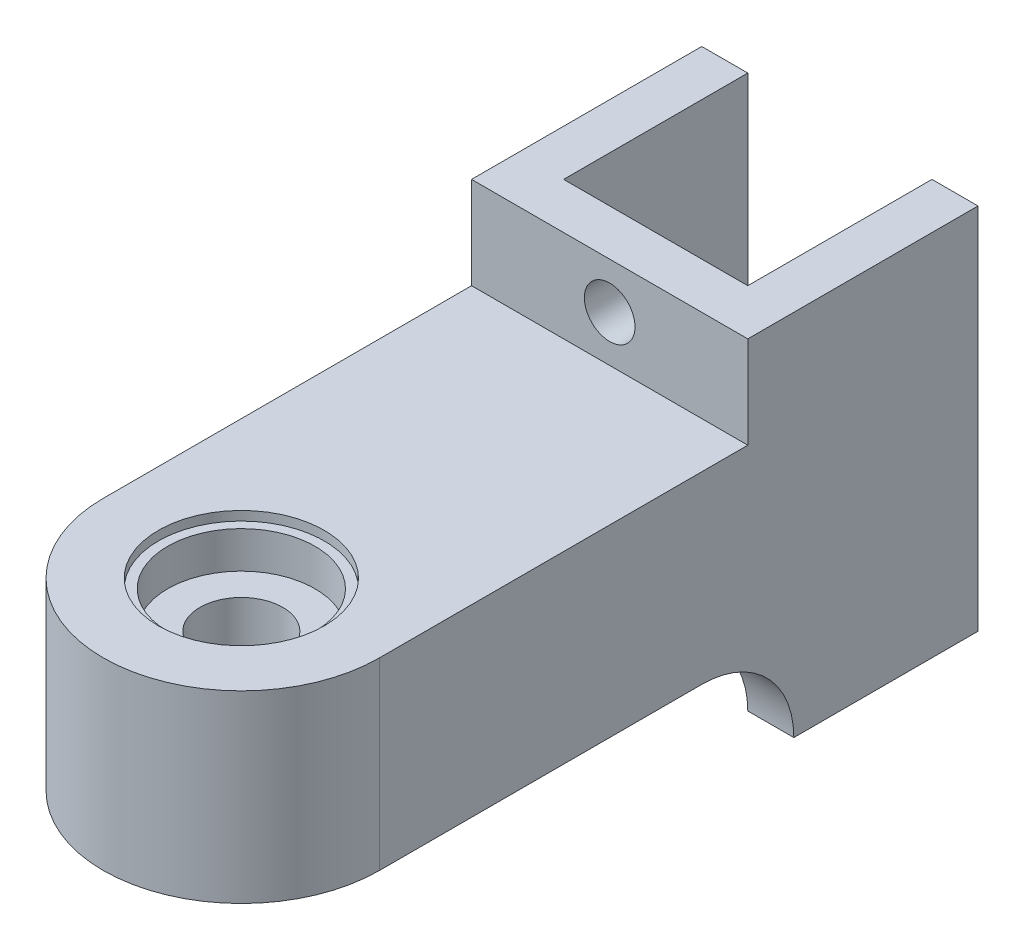
ISO-10303-21;
HEADER;
FILE_DESCRIPTION(('STEP AP214'),'2;1');
FILE_NAME('part.step','',(''),(''),'','','');
FILE_SCHEMA(('AUTOMOTIVE_DESIGN { 1 0 10303 214 1 1 1 1 }'));
ENDSEC;
DATA;
#1=APPLICATION_CONTEXT('core data for automotive mechanical design processes');
#2=APPLICATION_PROTOCOL_DEFINITION('international standard','automotive_design',2000,#1);
#3=PRODUCT_CONTEXT('',#1,'mechanical');
#4=PRODUCT('Part','Part','',(#3));
#5=PRODUCT_RELATED_PRODUCT_CATEGORY('part','',(#4));
#6=PRODUCT_DEFINITION_FORMATION('','',#4);
#7=PRODUCT_DEFINITION_CONTEXT('part definition',#1,'design');
#8=PRODUCT_DEFINITION('design','',#6,#7);
#9=PRODUCT_DEFINITION_SHAPE('','',#8);
#10=(LENGTH_UNIT() NAMED_UNIT(*) SI_UNIT(.MILLI.,.METRE.));
#11=(NAMED_UNIT(*) PLANE_ANGLE_UNIT() SI_UNIT($,.RADIAN.));
#12=(NAMED_UNIT(*) SI_UNIT($,.STERADIAN.) SOLID_ANGLE_UNIT());
#13=UNCERTAINTY_MEASURE_WITH_UNIT(LENGTH_MEASURE(1.E-05),#10,'distance_accuracy_value','');
#14=(GEOMETRIC_REPRESENTATION_CONTEXT(3) GLOBAL_UNCERTAINTY_ASSIGNED_CONTEXT((#13)) GLOBAL_UNIT_ASSIGNED_CONTEXT((#10,
#11,#12)) REPRESENTATION_CONTEXT('',''));
#15=CARTESIAN_POINT('',(0.,0.,0.));
#16=DIRECTION('',(0.,0.,1.));
#17=DIRECTION('',(1.,0.,0.));
#18=AXIS2_PLACEMENT_3D('',#15,#16,#17);
#19=CARTESIAN_POINT('',(0.,10.,0.));
#20=DIRECTION('',(0.,1.,0.));
#21=DIRECTION('',(0.,0.,1.));
#22=AXIS2_PLACEMENT_3D('',#19,#20,#21);
#23=PLANE('',#22);
#24=CARTESIAN_POINT('',(0.593220338983041,10.,56.3559322033898));
#25=DIRECTION('',(0.,1.,0.));
#26=DIRECTION('',(0.,0.,1.));
#27=AXIS2_PLACEMENT_3D('',#24,#25,#26);
#28=CIRCLE('',#27,9.);
#29=CARTESIAN_POINT('',(0.593220338983041,10.,65.3559322033898));
#30=VERTEX_POINT('',#29);
#31=EDGE_CURVE('E223',#30,#30,#28,.T.);
#32=ORIENTED_EDGE('',*,*,#31,.F.);
#33=EDGE_LOOP('',(#32));
#34=FACE_BOUND('',#33,.T.);
#35=DIRECTION('',(0.,0.,1.));
#36=VECTOR('',#35,1.);
#37=CARTESIAN_POINT('',(15.593220338983,10.,0.));
#38=LINE('',#37,#36);
#39=CARTESIAN_POINT('',(15.593220338983,10.,16.3559322033898));
#40=VERTEX_POINT('',#39);
#41=CARTESIAN_POINT('',(15.593220338983,10.,56.3559322033898));
#42=VERTEX_POINT('',#41);
#43=EDGE_CURVE('E220',#40,#42,#38,.T.);
#44=ORIENTED_EDGE('',*,*,#43,.F.);
#45=DIRECTION('',(1.,0.,0.));
#46=VECTOR('',#45,1.);
#47=CARTESIAN_POINT('',(-14.406779661017,10.,16.3559322033898));
#48=LINE('',#47,#46);
#49=CARTESIAN_POINT('',(-14.406779661017,10.,16.3559322033898));
#50=VERTEX_POINT('',#49);
#51=EDGE_CURVE('E158',#50,#40,#48,.T.);
#52=ORIENTED_EDGE('',*,*,#51,.F.);
#53=DIRECTION('',(0.,0.,1.));
#54=VECTOR('',#53,1.);
#55=CARTESIAN_POINT('',(-14.406779661017,10.,0.));
#56=LINE('',#55,#54);
#57=CARTESIAN_POINT('',(-14.406779661017,10.,56.3559322033898));
#58=VERTEX_POINT('',#57);
#59=EDGE_CURVE('E163',#50,#58,#56,.T.);
#60=ORIENTED_EDGE('',*,*,#59,.T.);
#61=CARTESIAN_POINT('',(0.593220338983041,10.,56.3559322033898));
#62=DIRECTION('',(0.,1.,0.));
#63=DIRECTION('',(0.,0.,1.));
#64=AXIS2_PLACEMENT_3D('',#61,#62,#63);
#65=CIRCLE('',#64,15.);
#66=EDGE_CURVE('E217',#58,#42,#65,.T.);
#67=ORIENTED_EDGE('',*,*,#66,.T.);
#68=EDGE_LOOP('',(#44,#52,#60,#67));
#69=FACE_BOUND('',#68,.T.);
#70=ADVANCED_FACE('F35',(#34,#69),#23,.T.);
#71=CARTESIAN_POINT('',(0.593220338983041,-9.,56.3559322033898));
#72=DIRECTION('',(0.,1.,0.));
#73=DIRECTION('',(0.,0.,1.));
#74=AXIS2_PLACEMENT_3D('',#71,#72,#73);
#75=CYLINDRICAL_SURFACE('',#74,8.);
#76=CARTESIAN_POINT('',(0.593220338983041,-9.,56.3559322033898));
#77=DIRECTION('',(0.,1.,0.));
#78=DIRECTION('',(0.,0.,1.));
#79=AXIS2_PLACEMENT_3D('',#76,#77,#78);
#80=CIRCLE('',#79,8.);
#81=CARTESIAN_POINT('',(0.593220338983041,-9.,64.3559322033898));
#82=VERTEX_POINT('',#81);
#83=EDGE_CURVE('E214',#82,#82,#80,.T.);
#84=ORIENTED_EDGE('',*,*,#83,.F.);
#85=EDGE_LOOP('',(#84));
#86=FACE_BOUND('',#85,.T.);
#87=CARTESIAN_POINT('',(0.593220338983041,-5.,56.3559322033898));
#88=DIRECTION('',(0.,1.,0.));
#89=DIRECTION('',(0.,0.,1.));
#90=AXIS2_PLACEMENT_3D('',#87,#88,#89);
#91=CIRCLE('',#90,8.);
#92=CARTESIAN_POINT('',(0.593220338983041,-5.,64.3559322033898));
#93=VERTEX_POINT('',#92);
#94=EDGE_CURVE('E258',#93,#93,#91,.F.);
#95=ORIENTED_EDGE('',*,*,#94,.F.);
#96=EDGE_LOOP('',(#95));
#97=FACE_BOUND('',#96,.T.);
#98=ADVANCED_FACE('F329',(#86,#97),#75,.F.);
#99=CARTESIAN_POINT('',(0.593220338983041,-10.,56.3559322033898));
#100=DIRECTION('',(0.,1.,0.));
#101=DIRECTION('',(0.,0.,1.));
#102=AXIS2_PLACEMENT_3D('',#99,#100,#101);
#103=CYLINDRICAL_SURFACE('',#102,9.);
#104=CARTESIAN_POINT('',(0.593220338983041,-10.,56.3559322033898));
#105=DIRECTION('',(0.,1.,0.));
#106=DIRECTION('',(0.,0.,1.));
#107=AXIS2_PLACEMENT_3D('',#104,#105,#106);
#108=CIRCLE('',#107,9.);
#109=CARTESIAN_POINT('',(0.593220338983041,-10.,65.3559322033898));
#110=VERTEX_POINT('',#109);
#111=EDGE_CURVE('E235',#110,#110,#108,.T.);
#112=ORIENTED_EDGE('',*,*,#111,.F.);
#113=EDGE_LOOP('',(#112));
#114=FACE_BOUND('',#113,.T.);
#115=CARTESIAN_POINT('',(0.593220338983041,-9.,56.3559322033898));
#116=DIRECTION('',(0.,1.,0.));
#117=DIRECTION('',(0.,0.,1.));
#118=AXIS2_PLACEMENT_3D('',#115,#116,#117);
#119=CIRCLE('',#118,9.);
#120=CARTESIAN_POINT('',(0.593220338983041,-9.,65.3559322033898));
#121=VERTEX_POINT('',#120);
#122=EDGE_CURVE('E241',#121,#121,#119,.F.);
#123=ORIENTED_EDGE('',*,*,#122,.F.);
#124=EDGE_LOOP('',(#123));
#125=FACE_BOUND('',#124,.T.);
#126=ADVANCED_FACE('F335',(#114,#125),#103,.F.);
#127=CARTESIAN_POINT('',(0.593220338983041,-10.,56.3559322033898));
#128=DIRECTION('',(0.,1.,0.));
#129=DIRECTION('',(0.,0.,1.));
#130=AXIS2_PLACEMENT_3D('',#127,#128,#129);
#131=CYLINDRICAL_SURFACE('',#130,15.);
#132=DIRECTION('',(0.,1.,0.));
#133=VECTOR('',#132,1.);
#134=CARTESIAN_POINT('',(15.593220338983,-10.,56.3559322033898));
#135=LINE('',#134,#133);
#136=CARTESIAN_POINT('',(15.593220338983,-10.,56.3559322033898));
#137=VERTEX_POINT('',#136);
#138=EDGE_CURVE('E238',#137,#42,#135,.T.);
#139=ORIENTED_EDGE('',*,*,#138,.T.);
#140=ORIENTED_EDGE('',*,*,#66,.F.);
#141=DIRECTION('',(0.,1.,0.));
#142=VECTOR('',#141,1.);
#143=CARTESIAN_POINT('',(-14.406779661017,-10.,56.3559322033898));
#144=LINE('',#143,#142);
#145=CARTESIAN_POINT('',(-14.406779661017,-10.,56.3559322033898));
#146=VERTEX_POINT('',#145);
#147=EDGE_CURVE('E239',#146,#58,#144,.T.);
#148=ORIENTED_EDGE('',*,*,#147,.F.);
#149=CARTESIAN_POINT('',(0.593220338983041,-10.,56.3559322033898));
#150=DIRECTION('',(0.,1.,0.));
#151=DIRECTION('',(0.,0.,1.));
#152=AXIS2_PLACEMENT_3D('',#149,#150,#151);
#153=CIRCLE('',#152,15.);
#154=EDGE_CURVE('E226',#146,#137,#153,.T.);
#155=ORIENTED_EDGE('',*,*,#154,.T.);
#156=EDGE_LOOP('',(#139,#140,#148,#155));
#157=FACE_BOUND('',#156,.T.);
#158=ADVANCED_FACE('F306',(#157),#131,.T.);
#159=CARTESIAN_POINT('',(-14.406779661017,-10.,0.));
#160=DIRECTION('',(-1.,0.,0.));
#161=DIRECTION('',(0.,0.,1.));
#162=AXIS2_PLACEMENT_3D('',#159,#160,#161);
#163=PLANE('',#162);
#164=ORIENTED_EDGE('',*,*,#59,.F.);
#165=DIRECTION('',(0.,-1.,0.));
#166=VECTOR('',#165,1.);
#167=CARTESIAN_POINT('',(-14.406779661017,20.,16.3559322033898));
#168=LINE('',#167,#166);
#169=CARTESIAN_POINT('',(-14.406779661017,20.,16.3559322033898));
#170=VERTEX_POINT('',#169);
#171=EDGE_CURVE('E153',#170,#50,#168,.T.);
#172=ORIENTED_EDGE('',*,*,#171,.F.);
#173=DIRECTION('',(0.,0.,1.));
#174=VECTOR('',#173,1.);
#175=CARTESIAN_POINT('',(-14.406779661017,20.,11.3559322033898));
#176=LINE('',#175,#174);
#177=CARTESIAN_POINT('',(-14.406779661017,20.,-8.64406779661018));
#178=VERTEX_POINT('',#177);
#179=EDGE_CURVE('E137',#178,#170,#176,.T.);
#180=ORIENTED_EDGE('',*,*,#179,.F.);
#181=DIRECTION('',(0.,1.,0.));
#182=VECTOR('',#181,1.);
#183=CARTESIAN_POINT('',(-14.406779661017,-10.,-8.64406779661018));
#184=LINE('',#183,#182);
#185=CARTESIAN_POINT('',(-14.406779661017,-20.,-8.64406779661018));
#186=VERTEX_POINT('',#185);
#187=EDGE_CURVE('E242',#186,#178,#184,.T.);
#188=ORIENTED_EDGE('',*,*,#187,.F.);
#189=DIRECTION('',(0.,0.,1.));
#190=VECTOR('',#189,1.);
#191=CARTESIAN_POINT('',(-14.406779661017,-20.,11.3559322033898));
#192=LINE('',#191,#190);
#193=CARTESIAN_POINT('',(-14.406779661017,-20.,11.3559322033898));
#194=VERTEX_POINT('',#193);
#195=EDGE_CURVE('E176',#186,#194,#192,.T.);
#196=ORIENTED_EDGE('',*,*,#195,.T.);
#197=CARTESIAN_POINT('',(-14.406779661017,-20.,21.3559322033898));
#198=DIRECTION('',(-1.,0.,0.));
#199=DIRECTION('',(0.,0.,1.));
#200=AXIS2_PLACEMENT_3D('',#197,#198,#199);
#201=CIRCLE('',#200,10.);
#202=CARTESIAN_POINT('',(-14.406779661017,-10.,21.3559322033898));
#203=VERTEX_POINT('',#202);
#204=EDGE_CURVE('E271',#194,#203,#201,.F.);
#205=ORIENTED_EDGE('',*,*,#204,.T.);
#206=DIRECTION('',(0.,0.,1.));
#207=VECTOR('',#206,1.);
#208=CARTESIAN_POINT('',(-14.406779661017,-10.,0.));
#209=LINE('',#208,#207);
#210=EDGE_CURVE('E233',#203,#146,#209,.T.);
#211=ORIENTED_EDGE('',*,*,#210,.T.);
#212=ORIENTED_EDGE('',*,*,#147,.T.);
#213=EDGE_LOOP('',(#164,#172,#180,#188,#196,#205,#211,#212));
#214=FACE_BOUND('',#213,.T.);
#215=ADVANCED_FACE('F161',(#214),#163,.T.);
#216=CARTESIAN_POINT('',(0.,-10.,-8.64406779661018));
#217=DIRECTION('',(0.,0.,1.));
#218=DIRECTION('',(1.,0.,0.));
#219=AXIS2_PLACEMENT_3D('',#216,#217,#218);
#220=PLANE('',#219);
#221=ORIENTED_EDGE('',*,*,#187,.T.);
#222=DIRECTION('',(-1.,0.,0.));
#223=VECTOR('',#222,1.);
#224=CARTESIAN_POINT('',(-9.40677966101696,20.,-8.64406779661018));
#225=LINE('',#224,#223);
#226=CARTESIAN_POINT('',(-9.40677966101696,20.,-8.64406779661018));
#227=VERTEX_POINT('',#226);
#228=EDGE_CURVE('E146',#227,#178,#225,.T.);
#229=ORIENTED_EDGE('',*,*,#228,.F.);
#230=DIRECTION('',(0.,1.,0.));
#231=VECTOR('',#230,1.);
#232=CARTESIAN_POINT('',(-9.40677966101696,-10.,-8.64406779661018));
#233=LINE('',#232,#231);
#234=CARTESIAN_POINT('',(-9.40677966101696,-20.,-8.64406779661018));
#235=VERTEX_POINT('',#234);
#236=EDGE_CURVE('E244',#235,#227,#233,.T.);
#237=ORIENTED_EDGE('',*,*,#236,.F.);
#238=DIRECTION('',(-1.,0.,0.));
#239=VECTOR('',#238,1.);
#240=CARTESIAN_POINT('',(-9.40677966101696,-20.,-8.64406779661018));
#241=LINE('',#240,#239);
#242=EDGE_CURVE('E173',#235,#186,#241,.T.);
#243=ORIENTED_EDGE('',*,*,#242,.T.);
#244=EDGE_LOOP('',(#221,#229,#237,#243));
#245=FACE_BOUND('',#244,.T.);
#246=ADVANCED_FACE('F319',(#245),#220,.F.);
#247=CARTESIAN_POINT('',(-9.40677966101696,-10.,0.));
#248=DIRECTION('',(1.,0.,0.));
#249=DIRECTION('',(0.,0.,-1.));
#250=AXIS2_PLACEMENT_3D('',#247,#248,#249);
#251=PLANE('',#250);
#252=ORIENTED_EDGE('',*,*,#236,.T.);
#253=DIRECTION('',(0.,0.,-1.));
#254=VECTOR('',#253,1.);
#255=CARTESIAN_POINT('',(-9.40677966101696,20.,11.3559322033898));
#256=LINE('',#255,#254);
#257=CARTESIAN_POINT('',(-9.40677966101696,20.,11.3559322033898));
#258=VERTEX_POINT('',#257);
#259=EDGE_CURVE('E164',#258,#227,#256,.T.);
#260=ORIENTED_EDGE('',*,*,#259,.F.);
#261=DIRECTION('',(0.,1.,0.));
#262=VECTOR('',#261,1.);
#263=CARTESIAN_POINT('',(-9.40677966101696,-10.,11.3559322033898));
#264=LINE('',#263,#262);
#265=CARTESIAN_POINT('',(-9.40677966101696,-10.,11.3559322033898));
#266=VERTEX_POINT('',#265);
#267=EDGE_CURVE('E246',#266,#258,#264,.T.);
#268=ORIENTED_EDGE('',*,*,#267,.F.);
#269=DIRECTION('',(0.,0.,-1.));
#270=VECTOR('',#269,1.);
#271=CARTESIAN_POINT('',(-9.40677966101696,-10.,0.));
#272=LINE('',#271,#270);
#273=CARTESIAN_POINT('',(-9.40677966101696,-10.,21.3559322033898));
#274=VERTEX_POINT('',#273);
#275=EDGE_CURVE('E265',#274,#266,#272,.T.);
#276=ORIENTED_EDGE('',*,*,#275,.F.);
#277=CARTESIAN_POINT('',(-9.40677966101696,-20.,21.3559322033898));
#278=DIRECTION('',(1.,0.,0.));
#279=DIRECTION('',(0.,0.,-1.));
#280=AXIS2_PLACEMENT_3D('',#277,#278,#279);
#281=CIRCLE('',#280,10.);
#282=CARTESIAN_POINT('',(-9.40677966101696,-20.,11.3559322033898));
#283=VERTEX_POINT('',#282);
#284=EDGE_CURVE('E57',#274,#283,#281,.F.);
#285=ORIENTED_EDGE('',*,*,#284,.T.);
#286=DIRECTION('',(0.,0.,-1.));
#287=VECTOR('',#286,1.);
#288=CARTESIAN_POINT('',(-9.40677966101696,-20.,11.3559322033898));
#289=LINE('',#288,#287);
#290=EDGE_CURVE('E149',#283,#235,#289,.T.);
#291=ORIENTED_EDGE('',*,*,#290,.T.);
#292=EDGE_LOOP('',(#252,#260,#268,#276,#285,#291));
#293=FACE_BOUND('',#292,.T.);
#294=ADVANCED_FACE('F317',(#293),#251,.T.);
#295=CARTESIAN_POINT('',(0.,-10.,11.3559322033898));
#296=DIRECTION('',(0.,0.,1.));
#297=DIRECTION('',(1.,0.,0.));
#298=AXIS2_PLACEMENT_3D('',#295,#296,#297);
#299=PLANE('',#298);
#300=CARTESIAN_POINT('',(0.593220338982972,15.,11.3559322033898));
#301=DIRECTION('',(0.,0.,1.));
#302=DIRECTION('',(1.,0.,0.));
#303=AXIS2_PLACEMENT_3D('',#300,#301,#302);
#304=CIRCLE('',#303,2.74999999999999);
#305=CARTESIAN_POINT('',(3.34322033898296,15.,11.3559322033898));
#306=VERTEX_POINT('',#305);
#307=EDGE_CURVE('E623',#306,#306,#304,.T.);
#308=ORIENTED_EDGE('',*,*,#307,.T.);
#309=EDGE_LOOP('',(#308));
#310=FACE_BOUND('',#309,.T.);
#311=ORIENTED_EDGE('',*,*,#267,.T.);
#312=DIRECTION('',(-1.,0.,0.));
#313=VECTOR('',#312,1.);
#314=CARTESIAN_POINT('',(-14.406779661017,20.,11.3559322033898));
#315=LINE('',#314,#313);
#316=CARTESIAN_POINT('',(10.593220338983,20.,11.3559322033898));
#317=VERTEX_POINT('',#316);
#318=EDGE_CURVE('E157',#317,#258,#315,.T.);
#319=ORIENTED_EDGE('',*,*,#318,.F.);
#320=DIRECTION('',(0.,1.,0.));
#321=VECTOR('',#320,1.);
#322=CARTESIAN_POINT('',(10.593220338983,-10.,11.3559322033898));
#323=LINE('',#322,#321);
#324=CARTESIAN_POINT('',(10.593220338983,-10.,11.3559322033898));
#325=VERTEX_POINT('',#324);
#326=EDGE_CURVE('E248',#325,#317,#323,.T.);
#327=ORIENTED_EDGE('',*,*,#326,.F.);
#328=DIRECTION('',(1.,0.,0.));
#329=VECTOR('',#328,1.);
#330=CARTESIAN_POINT('',(0.,-10.,11.3559322033898));
#331=LINE('',#330,#329);
#332=EDGE_CURVE('E231',#266,#325,#331,.T.);
#333=ORIENTED_EDGE('',*,*,#332,.F.);
#334=EDGE_LOOP('',(#311,#319,#327,#333));
#335=FACE_BOUND('',#334,.T.);
#336=ADVANCED_FACE('F294',(#310,#335),#299,.F.);
#337=CARTESIAN_POINT('',(10.593220338983,-10.,0.));
#338=DIRECTION('',(1.,0.,0.));
#339=DIRECTION('',(0.,0.,-1.));
#340=AXIS2_PLACEMENT_3D('',#337,#338,#339);
#341=PLANE('',#340);
#342=ORIENTED_EDGE('',*,*,#326,.T.);
#343=DIRECTION('',(0.,0.,1.));
#344=VECTOR('',#343,1.);
#345=CARTESIAN_POINT('',(10.593220338983,20.,11.3559322033898));
#346=LINE('',#345,#344);
#347=CARTESIAN_POINT('',(10.593220338983,20.,-8.64406779661018));
#348=VERTEX_POINT('',#347);
#349=EDGE_CURVE('E180',#348,#317,#346,.T.);
#350=ORIENTED_EDGE('',*,*,#349,.F.);
#351=DIRECTION('',(0.,1.,0.));
#352=VECTOR('',#351,1.);
#353=CARTESIAN_POINT('',(10.593220338983,-10.,-8.64406779661018));
#354=LINE('',#353,#352);
#355=CARTESIAN_POINT('',(10.593220338983,-20.,-8.64406779661018));
#356=VERTEX_POINT('',#355);
#357=EDGE_CURVE('E250',#356,#348,#354,.T.);
#358=ORIENTED_EDGE('',*,*,#357,.F.);
#359=DIRECTION('',(0.,0.,1.));
#360=VECTOR('',#359,1.);
#361=CARTESIAN_POINT('',(10.593220338983,-20.,11.3559322033898));
#362=LINE('',#361,#360);
#363=CARTESIAN_POINT('',(10.593220338983,-20.,11.3559322033898));
#364=VERTEX_POINT('',#363);
#365=EDGE_CURVE('E187',#356,#364,#362,.T.);
#366=ORIENTED_EDGE('',*,*,#365,.T.);
#367=CARTESIAN_POINT('',(10.593220338983,-20.,21.3559322033898));
#368=DIRECTION('',(1.,0.,0.));
#369=DIRECTION('',(0.,0.,-1.));
#370=AXIS2_PLACEMENT_3D('',#367,#368,#369);
#371=CIRCLE('',#370,10.);
#372=CARTESIAN_POINT('',(10.593220338983,-10.,21.3559322033898));
#373=VERTEX_POINT('',#372);
#374=EDGE_CURVE('E11',#364,#373,#371,.T.);
#375=ORIENTED_EDGE('',*,*,#374,.T.);
#376=DIRECTION('',(0.,0.,1.));
#377=VECTOR('',#376,1.);
#378=CARTESIAN_POINT('',(10.593220338983,-10.,0.));
#379=LINE('',#378,#377);
#380=EDGE_CURVE('E49',#325,#373,#379,.T.);
#381=ORIENTED_EDGE('',*,*,#380,.F.);
#382=EDGE_LOOP('',(#342,#350,#358,#366,#375,#381));
#383=FACE_BOUND('',#382,.T.);
#384=ADVANCED_FACE('F284',(#383),#341,.F.);
#385=CARTESIAN_POINT('',(0.,-10.,-8.64406779661018));
#386=DIRECTION('',(0.,0.,1.));
#387=DIRECTION('',(1.,0.,0.));
#388=AXIS2_PLACEMENT_3D('',#385,#386,#387);
#389=PLANE('',#388);
#390=ORIENTED_EDGE('',*,*,#357,.T.);
#391=DIRECTION('',(-1.,0.,0.));
#392=VECTOR('',#391,1.);
#393=CARTESIAN_POINT('',(10.593220338983,20.,-8.64406779661018));
#394=LINE('',#393,#392);
#395=CARTESIAN_POINT('',(15.593220338983,20.,-8.64406779661018));
#396=VERTEX_POINT('',#395);
#397=EDGE_CURVE('E184',#396,#348,#394,.T.);
#398=ORIENTED_EDGE('',*,*,#397,.F.);
#399=DIRECTION('',(0.,1.,0.));
#400=VECTOR('',#399,1.);
#401=CARTESIAN_POINT('',(15.593220338983,-10.,-8.64406779661018));
#402=LINE('',#401,#400);
#403=CARTESIAN_POINT('',(15.593220338983,-20.,-8.64406779661018));
#404=VERTEX_POINT('',#403);
#405=EDGE_CURVE('E252',#404,#396,#402,.T.);
#406=ORIENTED_EDGE('',*,*,#405,.F.);
#407=DIRECTION('',(-1.,0.,0.));
#408=VECTOR('',#407,1.);
#409=CARTESIAN_POINT('',(10.593220338983,-20.,-8.64406779661018));
#410=LINE('',#409,#408);
#411=EDGE_CURVE('E196',#404,#356,#410,.T.);
#412=ORIENTED_EDGE('',*,*,#411,.T.);
#413=EDGE_LOOP('',(#390,#398,#406,#412));
#414=FACE_BOUND('',#413,.T.);
#415=ADVANCED_FACE('F300',(#414),#389,.F.);
#416=CARTESIAN_POINT('',(15.593220338983,-10.,0.));
#417=DIRECTION('',(-1.,0.,0.));
#418=DIRECTION('',(0.,0.,1.));
#419=AXIS2_PLACEMENT_3D('',#416,#417,#418);
#420=PLANE('',#419);
#421=DIRECTION('',(0.,-1.,0.));
#422=VECTOR('',#421,1.);
#423=CARTESIAN_POINT('',(15.593220338983,20.,16.3559322033898));
#424=LINE('',#423,#422);
#425=CARTESIAN_POINT('',(15.593220338983,20.,16.3559322033898));
#426=VERTEX_POINT('',#425);
#427=EDGE_CURVE('E156',#426,#40,#424,.T.);
#428=ORIENTED_EDGE('',*,*,#427,.T.);
#429=ORIENTED_EDGE('',*,*,#43,.T.);
#430=ORIENTED_EDGE('',*,*,#138,.F.);
#431=DIRECTION('',(0.,0.,1.));
#432=VECTOR('',#431,1.);
#433=CARTESIAN_POINT('',(15.593220338983,-10.,0.));
#434=LINE('',#433,#432);
#435=CARTESIAN_POINT('',(15.593220338983,-10.,21.3559322033898));
#436=VERTEX_POINT('',#435);
#437=EDGE_CURVE('E229',#436,#137,#434,.T.);
#438=ORIENTED_EDGE('',*,*,#437,.F.);
#439=CARTESIAN_POINT('',(15.593220338983,-20.,21.3559322033898));
#440=DIRECTION('',(-1.,0.,0.));
#441=DIRECTION('',(0.,0.,1.));
#442=AXIS2_PLACEMENT_3D('',#439,#440,#441);
#443=CIRCLE('',#442,10.);
#444=CARTESIAN_POINT('',(15.593220338983,-20.,11.3559322033898));
#445=VERTEX_POINT('',#444);
#446=EDGE_CURVE('E43',#436,#445,#443,.T.);
#447=ORIENTED_EDGE('',*,*,#446,.T.);
#448=DIRECTION('',(0.,0.,-1.));
#449=VECTOR('',#448,1.);
#450=CARTESIAN_POINT('',(15.593220338983,-20.,11.3559322033898));
#451=LINE('',#450,#449);
#452=EDGE_CURVE('E193',#445,#404,#451,.T.);
#453=ORIENTED_EDGE('',*,*,#452,.T.);
#454=ORIENTED_EDGE('',*,*,#405,.T.);
#455=DIRECTION('',(0.,0.,-1.));
#456=VECTOR('',#455,1.);
#457=CARTESIAN_POINT('',(15.593220338983,20.,11.3559322033898));
#458=LINE('',#457,#456);
#459=EDGE_CURVE('E182',#426,#396,#458,.T.);
#460=ORIENTED_EDGE('',*,*,#459,.F.);
#461=EDGE_LOOP('',(#428,#429,#430,#438,#447,#453,#454,#460));
#462=FACE_BOUND('',#461,.T.);
#463=ADVANCED_FACE('F275',(#462),#420,.F.);
#464=CARTESIAN_POINT('',(0.593220338983041,9.,56.3559322033898));
#465=DIRECTION('',(0.,1.,0.));
#466=DIRECTION('',(0.,0.,1.));
#467=AXIS2_PLACEMENT_3D('',#464,#465,#466);
#468=CIRCLE('',#467,9.);
#469=CARTESIAN_POINT('',(0.593220338983041,9.,65.3559322033898));
#470=VERTEX_POINT('',#469);
#471=EDGE_CURVE('E208',#470,#470,#468,.T.);
#472=ORIENTED_EDGE('',*,*,#471,.F.);
#473=EDGE_LOOP('',(#472));
#474=FACE_BOUND('',#473,.T.);
#475=ORIENTED_EDGE('',*,*,#31,.T.);
#476=EDGE_LOOP('',(#475));
#477=FACE_BOUND('',#476,.T.);
#478=ADVANCED_FACE('F344',(#474,#477),#103,.F.);
#479=CARTESIAN_POINT('',(0.,-10.,0.));
#480=DIRECTION('',(0.,1.,0.));
#481=DIRECTION('',(0.,0.,1.));
#482=AXIS2_PLACEMENT_3D('',#479,#480,#481);
#483=PLANE('',#482);
#484=ORIENTED_EDGE('',*,*,#210,.F.);
#485=DIRECTION('',(1.,0.,0.));
#486=VECTOR('',#485,1.);
#487=CARTESIAN_POINT('',(0.,-10.,21.3559322033898));
#488=LINE('',#487,#486);
#489=EDGE_CURVE('E267',#203,#274,#488,.T.);
#490=ORIENTED_EDGE('',*,*,#489,.T.);
#491=ORIENTED_EDGE('',*,*,#275,.T.);
#492=ORIENTED_EDGE('',*,*,#332,.T.);
#493=ORIENTED_EDGE('',*,*,#380,.T.);
#494=DIRECTION('',(1.,0.,0.));
#495=VECTOR('',#494,1.);
#496=CARTESIAN_POINT('',(0.,-10.,21.3559322033898));
#497=LINE('',#496,#495);
#498=EDGE_CURVE('E262',#373,#436,#497,.T.);
#499=ORIENTED_EDGE('',*,*,#498,.T.);
#500=ORIENTED_EDGE('',*,*,#437,.T.);
#501=ORIENTED_EDGE('',*,*,#154,.F.);
#502=EDGE_LOOP('',(#484,#490,#491,#492,#493,#499,#500,#501));
#503=FACE_BOUND('',#502,.T.);
#504=ORIENTED_EDGE('',*,*,#111,.T.);
#505=EDGE_LOOP('',(#504));
#506=FACE_BOUND('',#505,.T.);
#507=ADVANCED_FACE('F287',(#503,#506),#483,.F.);
#508=CARTESIAN_POINT('',(0.593220338983041,5.,56.3559322033898));
#509=DIRECTION('',(0.,1.,0.));
#510=DIRECTION('',(0.,0.,1.));
#511=AXIS2_PLACEMENT_3D('',#508,#509,#510);
#512=CIRCLE('',#511,8.);
#513=CARTESIAN_POINT('',(0.593220338983041,5.,64.3559322033898));
#514=VERTEX_POINT('',#513);
#515=EDGE_CURVE('E199',#514,#514,#512,.T.);
#516=ORIENTED_EDGE('',*,*,#515,.F.);
#517=EDGE_LOOP('',(#516));
#518=FACE_BOUND('',#517,.T.);
#519=CARTESIAN_POINT('',(0.593220338983041,9.,56.3559322033898));
#520=DIRECTION('',(0.,1.,0.));
#521=DIRECTION('',(0.,0.,1.));
#522=AXIS2_PLACEMENT_3D('',#519,#520,#521);
#523=CIRCLE('',#522,8.);
#524=CARTESIAN_POINT('',(0.593220338983041,9.,64.3559322033898));
#525=VERTEX_POINT('',#524);
#526=EDGE_CURVE('E211',#525,#525,#523,.T.);
#527=ORIENTED_EDGE('',*,*,#526,.T.);
#528=EDGE_LOOP('',(#527));
#529=FACE_BOUND('',#528,.T.);
#530=ADVANCED_FACE('F338',(#518,#529),#75,.F.);
#531=CARTESIAN_POINT('',(0.,-9.,0.));
#532=DIRECTION('',(0.,1.,0.));
#533=DIRECTION('',(0.,0.,1.));
#534=AXIS2_PLACEMENT_3D('',#531,#532,#533);
#535=PLANE('',#534);
#536=ORIENTED_EDGE('',*,*,#122,.T.);
#537=EDGE_LOOP('',(#536));
#538=FACE_BOUND('',#537,.T.);
#539=ORIENTED_EDGE('',*,*,#83,.T.);
#540=EDGE_LOOP('',(#539));
#541=FACE_BOUND('',#540,.T.);
#542=ADVANCED_FACE('F363',(#538,#541),#535,.F.);
#543=CARTESIAN_POINT('',(0.,9.,0.));
#544=DIRECTION('',(0.,1.,0.));
#545=DIRECTION('',(0.,0.,1.));
#546=AXIS2_PLACEMENT_3D('',#543,#544,#545);
#547=PLANE('',#546);
#548=ORIENTED_EDGE('',*,*,#471,.T.);
#549=EDGE_LOOP('',(#548));
#550=FACE_BOUND('',#549,.T.);
#551=ORIENTED_EDGE('',*,*,#526,.F.);
#552=EDGE_LOOP('',(#551));
#553=FACE_BOUND('',#552,.T.);
#554=ADVANCED_FACE('F366',(#550,#553),#547,.T.);
#555=CARTESIAN_POINT('',(0.593220338983041,-5.,56.3559322033898));
#556=DIRECTION('',(0.,1.,0.));
#557=DIRECTION('',(0.,0.,1.));
#558=AXIS2_PLACEMENT_3D('',#555,#556,#557);
#559=CYLINDRICAL_SURFACE('',#558,4.5);
#560=CARTESIAN_POINT('',(0.593220338983041,-5.,56.3559322033898));
#561=DIRECTION('',(0.,1.,0.));
#562=DIRECTION('',(0.,0.,1.));
#563=AXIS2_PLACEMENT_3D('',#560,#561,#562);
#564=CIRCLE('',#563,4.5);
#565=CARTESIAN_POINT('',(0.593220338983041,-5.,60.8559322033898));
#566=VERTEX_POINT('',#565);
#567=EDGE_CURVE('E205',#566,#566,#564,.T.);
#568=ORIENTED_EDGE('',*,*,#567,.F.);
#569=EDGE_LOOP('',(#568));
#570=FACE_BOUND('',#569,.T.);
#571=CARTESIAN_POINT('',(0.593220338983041,5.,56.3559322033898));
#572=DIRECTION('',(0.,1.,0.));
#573=DIRECTION('',(0.,0.,1.));
#574=AXIS2_PLACEMENT_3D('',#571,#572,#573);
#575=CIRCLE('',#574,4.5);
#576=CARTESIAN_POINT('',(0.593220338983041,5.,60.8559322033898));
#577=VERTEX_POINT('',#576);
#578=EDGE_CURVE('E202',#577,#577,#575,.T.);
#579=ORIENTED_EDGE('',*,*,#578,.T.);
#580=EDGE_LOOP('',(#579));
#581=FACE_BOUND('',#580,.T.);
#582=ADVANCED_FACE('F375',(#570,#581),#559,.F.);
#583=CARTESIAN_POINT('',(0.,-5.,0.));
#584=DIRECTION('',(0.,1.,0.));
#585=DIRECTION('',(0.,0.,1.));
#586=AXIS2_PLACEMENT_3D('',#583,#584,#585);
#587=PLANE('',#586);
#588=ORIENTED_EDGE('',*,*,#94,.T.);
#589=EDGE_LOOP('',(#588));
#590=FACE_BOUND('',#589,.T.);
#591=ORIENTED_EDGE('',*,*,#567,.T.);
#592=EDGE_LOOP('',(#591));
#593=FACE_BOUND('',#592,.T.);
#594=ADVANCED_FACE('F371',(#590,#593),#587,.F.);
#595=CARTESIAN_POINT('',(0.,5.,0.));
#596=DIRECTION('',(0.,1.,0.));
#597=DIRECTION('',(0.,0.,1.));
#598=AXIS2_PLACEMENT_3D('',#595,#596,#597);
#599=PLANE('',#598);
#600=ORIENTED_EDGE('',*,*,#515,.T.);
#601=EDGE_LOOP('',(#600));
#602=FACE_BOUND('',#601,.T.);
#603=ORIENTED_EDGE('',*,*,#578,.F.);
#604=EDGE_LOOP('',(#603));
#605=FACE_BOUND('',#604,.T.);
#606=ADVANCED_FACE('F374',(#602,#605),#599,.T.);
#607=CARTESIAN_POINT('',(0.,20.,0.));
#608=DIRECTION('',(0.,-1.,0.));
#609=DIRECTION('',(0.,0.,-1.));
#610=AXIS2_PLACEMENT_3D('',#607,#608,#609);
#611=PLANE('',#610);
#612=ORIENTED_EDGE('',*,*,#349,.T.);
#613=ORIENTED_EDGE('',*,*,#318,.T.);
#614=ORIENTED_EDGE('',*,*,#259,.T.);
#615=ORIENTED_EDGE('',*,*,#228,.T.);
#616=ORIENTED_EDGE('',*,*,#179,.T.);
#617=DIRECTION('',(1.,0.,0.));
#618=VECTOR('',#617,1.);
#619=CARTESIAN_POINT('',(-14.406779661017,20.,16.3559322033898));
#620=LINE('',#619,#618);
#621=EDGE_CURVE('E142',#170,#426,#620,.T.);
#622=ORIENTED_EDGE('',*,*,#621,.T.);
#623=ORIENTED_EDGE('',*,*,#459,.T.);
#624=ORIENTED_EDGE('',*,*,#397,.T.);
#625=EDGE_LOOP('',(#612,#613,#614,#615,#616,#622,#623,#624));
#626=FACE_BOUND('',#625,.T.);
#627=ADVANCED_FACE('F140',(#626),#611,.F.);
#628=CARTESIAN_POINT('',(0.,-20.,0.));
#629=DIRECTION('',(0.,-1.,0.));
#630=DIRECTION('',(0.,0.,-1.));
#631=AXIS2_PLACEMENT_3D('',#628,#629,#630);
#632=PLANE('',#631);
#633=ORIENTED_EDGE('',*,*,#365,.F.);
#634=ORIENTED_EDGE('',*,*,#411,.F.);
#635=ORIENTED_EDGE('',*,*,#452,.F.);
#636=DIRECTION('',(1.,0.,0.));
#637=VECTOR('',#636,1.);
#638=CARTESIAN_POINT('',(10.593220338983,-20.,11.3559322033898));
#639=LINE('',#638,#637);
#640=EDGE_CURVE('E190',#364,#445,#639,.T.);
#641=ORIENTED_EDGE('',*,*,#640,.F.);
#642=EDGE_LOOP('',(#633,#634,#635,#641));
#643=FACE_BOUND('',#642,.T.);
#644=ADVANCED_FACE('F282',(#643),#632,.T.);
#645=CARTESIAN_POINT('',(0.,-20.,0.));
#646=DIRECTION('',(0.,1.,0.));
#647=DIRECTION('',(0.,0.,1.));
#648=AXIS2_PLACEMENT_3D('',#645,#646,#647);
#649=PLANE('',#648);
#650=ORIENTED_EDGE('',*,*,#290,.F.);
#651=DIRECTION('',(1.,0.,0.));
#652=VECTOR('',#651,1.);
#653=CARTESIAN_POINT('',(-9.40677966101696,-20.,11.3559322033898));
#654=LINE('',#653,#652);
#655=EDGE_CURVE('E178',#194,#283,#654,.T.);
#656=ORIENTED_EDGE('',*,*,#655,.F.);
#657=ORIENTED_EDGE('',*,*,#195,.F.);
#658=ORIENTED_EDGE('',*,*,#242,.F.);
#659=EDGE_LOOP('',(#650,#656,#657,#658));
#660=FACE_BOUND('',#659,.T.);
#661=ADVANCED_FACE('F315',(#660),#649,.F.);
#662=CARTESIAN_POINT('',(-14.406779661017,20.,16.3559322033898));
#663=DIRECTION('',(0.,0.,-1.));
#664=DIRECTION('',(-1.,0.,0.));
#665=AXIS2_PLACEMENT_3D('',#662,#663,#664);
#666=PLANE('',#665);
#667=CARTESIAN_POINT('',(0.593220338982972,15.,16.3559322033898));
#668=DIRECTION('',(0.,0.,1.));
#669=DIRECTION('',(1.,0.,0.));
#670=AXIS2_PLACEMENT_3D('',#667,#668,#669);
#671=CIRCLE('',#670,2.74999999999999);
#672=CARTESIAN_POINT('',(3.34322033898296,15.,16.3559322033898));
#673=VERTEX_POINT('',#672);
#674=EDGE_CURVE('E620',#673,#673,#671,.T.);
#675=ORIENTED_EDGE('',*,*,#674,.F.);
#676=EDGE_LOOP('',(#675));
#677=FACE_BOUND('',#676,.T.);
#678=ORIENTED_EDGE('',*,*,#51,.T.);
#679=ORIENTED_EDGE('',*,*,#427,.F.);
#680=ORIENTED_EDGE('',*,*,#621,.F.);
#681=ORIENTED_EDGE('',*,*,#171,.T.);
#682=EDGE_LOOP('',(#678,#679,#680,#681));
#683=FACE_BOUND('',#682,.T.);
#684=ADVANCED_FACE('F152',(#677,#683),#666,.F.);
#685=CARTESIAN_POINT('',(0.,-20.,21.3559322033898));
#686=DIRECTION('',(1.,0.,0.));
#687=DIRECTION('',(0.,0.,-1.));
#688=AXIS2_PLACEMENT_3D('',#685,#686,#687);
#689=CYLINDRICAL_SURFACE('',#688,10.);
#690=ORIENTED_EDGE('',*,*,#204,.F.);
#691=ORIENTED_EDGE('',*,*,#655,.T.);
#692=ORIENTED_EDGE('',*,*,#284,.F.);
#693=ORIENTED_EDGE('',*,*,#489,.F.);
#694=EDGE_LOOP('',(#690,#691,#692,#693));
#695=FACE_BOUND('',#694,.T.);
#696=ADVANCED_FACE('F309',(#695),#689,.F.);
#697=CARTESIAN_POINT('',(0.,-20.,21.3559322033898));
#698=DIRECTION('',(1.,0.,0.));
#699=DIRECTION('',(0.,0.,-1.));
#700=AXIS2_PLACEMENT_3D('',#697,#698,#699);
#701=CYLINDRICAL_SURFACE('',#700,10.);
#702=ORIENTED_EDGE('',*,*,#374,.F.);
#703=ORIENTED_EDGE('',*,*,#640,.T.);
#704=ORIENTED_EDGE('',*,*,#446,.F.);
#705=ORIENTED_EDGE('',*,*,#498,.F.);
#706=EDGE_LOOP('',(#702,#703,#704,#705));
#707=FACE_BOUND('',#706,.T.);
#708=ADVANCED_FACE('F37',(#707),#701,.F.);
#709=CARTESIAN_POINT('',(0.593220338982972,15.,16.3559322033898));
#710=DIRECTION('',(0.,0.,1.));
#711=DIRECTION('',(1.,0.,0.));
#712=AXIS2_PLACEMENT_3D('',#709,#710,#711);
#713=CYLINDRICAL_SURFACE('',#712,2.74999999999999);
#714=ORIENTED_EDGE('',*,*,#674,.T.);
#715=EDGE_LOOP('',(#714));
#716=FACE_BOUND('',#715,.T.);
#717=ORIENTED_EDGE('',*,*,#307,.F.);
#718=EDGE_LOOP('',(#717));
#719=FACE_BOUND('',#718,.T.);
#720=ADVANCED_FACE('F601',(#716,#719),#713,.F.);
#721=CLOSED_SHELL('',(#70,#98,#126,#158,#215,#246,#294,#336,#384,#415,#463,#478,#507,#530,#542,
#554,#582,#594,#606,#627,#644,#661,#684,#696,#708,#720));
#722=MANIFOLD_SOLID_BREP('B2',#721);
#723=ADVANCED_BREP_SHAPE_REPRESENTATION('',(#18,#722),#14);
#724=SHAPE_DEFINITION_REPRESENTATION(#9,#723);
ENDSEC;
END-ISO-10303-21;
